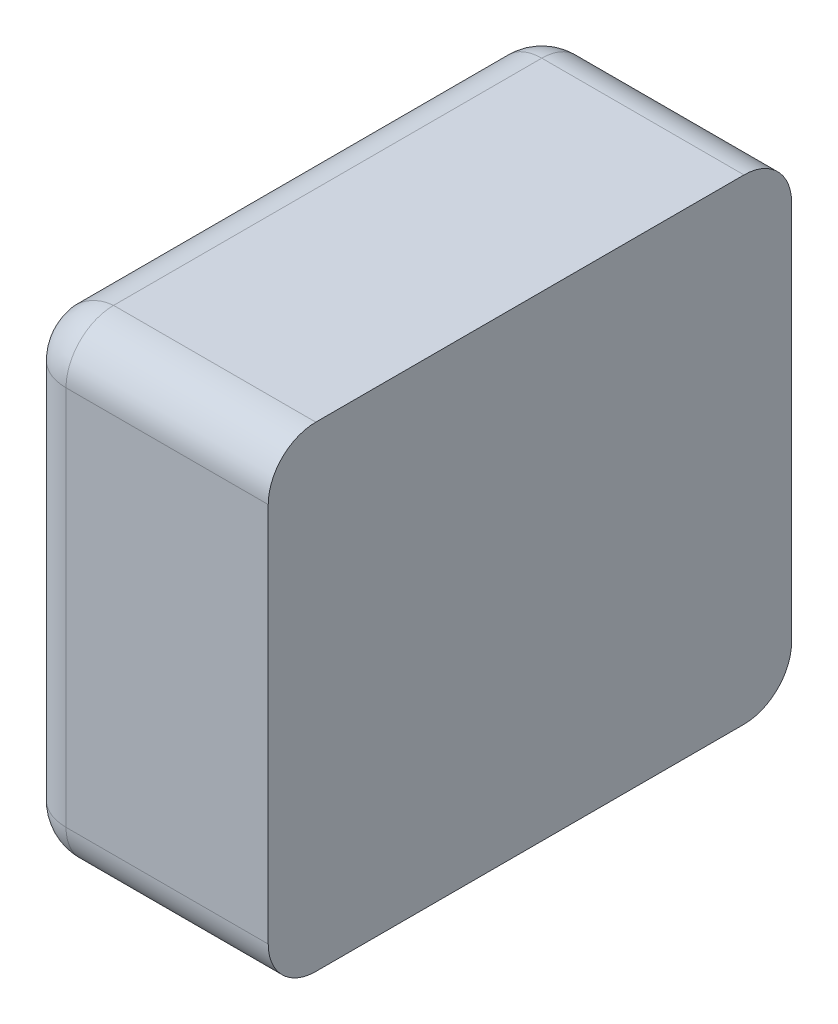
ISO-10303-21;
HEADER;
FILE_DESCRIPTION(('STEP AP214'),'2;1');
FILE_NAME('part.step','',(''),(''),'','','');
FILE_SCHEMA(('AUTOMOTIVE_DESIGN { 1 0 10303 214 1 1 1 1 }'));
ENDSEC;
DATA;
#1=APPLICATION_CONTEXT('core data for automotive mechanical design processes');
#2=APPLICATION_PROTOCOL_DEFINITION('international standard','automotive_design',2000,#1);
#3=PRODUCT_CONTEXT('',#1,'mechanical');
#4=PRODUCT('Part','Part','',(#3));
#5=PRODUCT_RELATED_PRODUCT_CATEGORY('part','',(#4));
#6=PRODUCT_DEFINITION_FORMATION('','',#4);
#7=PRODUCT_DEFINITION_CONTEXT('part definition',#1,'design');
#8=PRODUCT_DEFINITION('design','',#6,#7);
#9=PRODUCT_DEFINITION_SHAPE('','',#8);
#10=(LENGTH_UNIT() NAMED_UNIT(*) SI_UNIT(.MILLI.,.METRE.));
#11=(NAMED_UNIT(*) PLANE_ANGLE_UNIT() SI_UNIT($,.RADIAN.));
#12=(NAMED_UNIT(*) SI_UNIT($,.STERADIAN.) SOLID_ANGLE_UNIT());
#13=UNCERTAINTY_MEASURE_WITH_UNIT(LENGTH_MEASURE(1.E-05),#10,'distance_accuracy_value','');
#14=(GEOMETRIC_REPRESENTATION_CONTEXT(3) GLOBAL_UNCERTAINTY_ASSIGNED_CONTEXT((#13)) GLOBAL_UNIT_ASSIGNED_CONTEXT((#10,
#11,#12)) REPRESENTATION_CONTEXT('',''));
#15=CARTESIAN_POINT('',(0.,0.,0.));
#16=DIRECTION('',(0.,0.,1.));
#17=DIRECTION('',(1.,0.,0.));
#18=AXIS2_PLACEMENT_3D('',#15,#16,#17);
#19=CARTESIAN_POINT('',(-0.1425,0.331275705796617,0.33));
#20=DIRECTION('',(-1.,0.,0.));
#21=DIRECTION('',(0.,-1.,0.));
#22=AXIS2_PLACEMENT_3D('',#19,#20,#21);
#23=PLANE('',#22);
#24=CARTESIAN_POINT('',(-0.1425,0.12,0.3));
#25=DIRECTION('',(-1.,0.,0.));
#26=DIRECTION('',(0.,0.707106781186548,0.707106781186547));
#27=AXIS2_PLACEMENT_3D('',#24,#25,#26);
#28=CIRCLE('',#27,0.03);
#29=CARTESIAN_POINT('',(-0.1425,0.12,0.33));
#30=VERTEX_POINT('',#29);
#31=CARTESIAN_POINT('',(-0.1425,0.15,0.3));
#32=VERTEX_POINT('',#31);
#33=EDGE_CURVE('E11',#30,#32,#28,.T.);
#34=ORIENTED_EDGE('',*,*,#33,.F.);
#35=DIRECTION('',(0.,1.,0.));
#36=VECTOR('',#35,1.);
#37=CARTESIAN_POINT('',(-0.1425,0.165637852898309,0.33));
#38=LINE('',#37,#36);
#39=CARTESIAN_POINT('',(-0.1425,-0.12,0.33));
#40=VERTEX_POINT('',#39);
#41=EDGE_CURVE('E24',#40,#30,#38,.T.);
#42=ORIENTED_EDGE('',*,*,#41,.F.);
#43=CARTESIAN_POINT('',(-0.1425,-0.12,0.3));
#44=DIRECTION('',(-1.,0.,0.));
#45=DIRECTION('',(0.,-0.707106781186548,0.707106781186547));
#46=AXIS2_PLACEMENT_3D('',#43,#44,#45);
#47=CIRCLE('',#46,0.03);
#48=CARTESIAN_POINT('',(-0.1425,-0.15,0.3));
#49=VERTEX_POINT('',#48);
#50=EDGE_CURVE('E307',#49,#40,#47,.T.);
#51=ORIENTED_EDGE('',*,*,#50,.F.);
#52=DIRECTION('',(0.,0.,1.));
#53=VECTOR('',#52,1.);
#54=CARTESIAN_POINT('',(-0.1425,-0.15,0.165));
#55=LINE('',#54,#53);
#56=CARTESIAN_POINT('',(-0.1425,-0.15,0.03));
#57=VERTEX_POINT('',#56);
#58=EDGE_CURVE('E304',#57,#49,#55,.T.);
#59=ORIENTED_EDGE('',*,*,#58,.F.);
#60=CARTESIAN_POINT('',(-0.1425,-0.12,0.03));
#61=DIRECTION('',(-1.,0.,0.));
#62=DIRECTION('',(0.,-0.707106781186547,-0.707106781186548));
#63=AXIS2_PLACEMENT_3D('',#60,#61,#62);
#64=CIRCLE('',#63,0.03);
#65=CARTESIAN_POINT('',(-0.1425,-0.12,0.));
#66=VERTEX_POINT('',#65);
#67=EDGE_CURVE('E301',#66,#57,#64,.T.);
#68=ORIENTED_EDGE('',*,*,#67,.F.);
#69=DIRECTION('',(0.,-1.,0.));
#70=VECTOR('',#69,1.);
#71=CARTESIAN_POINT('',(-0.1425,0.165637852898309,0.));
#72=LINE('',#71,#70);
#73=CARTESIAN_POINT('',(-0.1425,0.12,0.));
#74=VERTEX_POINT('',#73);
#75=EDGE_CURVE('E298',#74,#66,#72,.T.);
#76=ORIENTED_EDGE('',*,*,#75,.F.);
#77=CARTESIAN_POINT('',(-0.1425,0.12,0.03));
#78=DIRECTION('',(-1.,0.,0.));
#79=DIRECTION('',(0.,0.707106781186547,-0.707106781186548));
#80=AXIS2_PLACEMENT_3D('',#77,#78,#79);
#81=CIRCLE('',#80,0.03);
#82=CARTESIAN_POINT('',(-0.1425,0.15,0.03));
#83=VERTEX_POINT('',#82);
#84=EDGE_CURVE('E295',#83,#74,#81,.T.);
#85=ORIENTED_EDGE('',*,*,#84,.F.);
#86=DIRECTION('',(0.,0.,-1.));
#87=VECTOR('',#86,1.);
#88=CARTESIAN_POINT('',(-0.1425,0.15,0.165));
#89=LINE('',#88,#87);
#90=EDGE_CURVE('E292',#32,#83,#89,.T.);
#91=ORIENTED_EDGE('',*,*,#90,.F.);
#92=EDGE_LOOP('',(#34,#42,#51,#59,#68,#76,#85,#91));
#93=FACE_BOUND('',#92,.T.);
#94=ADVANCED_FACE('F17',(#93),#23,.F.);
#95=CARTESIAN_POINT('',(-0.3,-0.15,0.));
#96=DIRECTION('',(0.,-1.,0.));
#97=DIRECTION('',(1.,0.,0.));
#98=AXIS2_PLACEMENT_3D('',#95,#96,#97);
#99=PLANE('',#98);
#100=ORIENTED_EDGE('',*,*,#58,.T.);
#101=DIRECTION('',(1.,0.,0.));
#102=VECTOR('',#101,1.);
#103=CARTESIAN_POINT('',(-0.15,-0.15,0.3));
#104=LINE('',#103,#102);
#105=CARTESIAN_POINT('',(-0.27,-0.15,0.3));
#106=VERTEX_POINT('',#105);
#107=EDGE_CURVE('E290',#106,#49,#104,.T.);
#108=ORIENTED_EDGE('',*,*,#107,.F.);
#109=DIRECTION('',(0.,0.,1.));
#110=VECTOR('',#109,1.);
#111=CARTESIAN_POINT('',(-0.27,-0.15,0.));
#112=LINE('',#111,#110);
#113=CARTESIAN_POINT('',(-0.27,-0.15,0.03));
#114=VERTEX_POINT('',#113);
#115=EDGE_CURVE('E285',#114,#106,#112,.T.);
#116=ORIENTED_EDGE('',*,*,#115,.F.);
#117=DIRECTION('',(-1.,0.,0.));
#118=VECTOR('',#117,1.);
#119=CARTESIAN_POINT('',(-0.15,-0.15,0.03));
#120=LINE('',#119,#118);
#121=EDGE_CURVE('E283',#57,#114,#120,.T.);
#122=ORIENTED_EDGE('',*,*,#121,.F.);
#123=EDGE_LOOP('',(#100,#108,#116,#122));
#124=FACE_BOUND('',#123,.T.);
#125=ADVANCED_FACE('F268',(#124),#99,.T.);
#126=CARTESIAN_POINT('',(-0.15,-0.12,0.03));
#127=DIRECTION('',(1.,0.,0.));
#128=DIRECTION('',(0.,-0.707106781186547,-0.707106781186548));
#129=AXIS2_PLACEMENT_3D('',#126,#127,#128);
#130=CYLINDRICAL_SURFACE('',#129,0.03);
#131=ORIENTED_EDGE('',*,*,#67,.T.);
#132=ORIENTED_EDGE('',*,*,#121,.T.);
#133=CARTESIAN_POINT('',(-0.27,-0.12,0.03));
#134=DIRECTION('',(1.,0.,0.));
#135=DIRECTION('',(0.,-1.,0.));
#136=AXIS2_PLACEMENT_3D('',#133,#134,#135);
#137=CIRCLE('',#136,0.03);
#138=CARTESIAN_POINT('',(-0.27,-0.12,0.));
#139=VERTEX_POINT('',#138);
#140=EDGE_CURVE('E229',#114,#139,#137,.T.);
#141=ORIENTED_EDGE('',*,*,#140,.T.);
#142=DIRECTION('',(1.,0.,0.));
#143=VECTOR('',#142,1.);
#144=CARTESIAN_POINT('',(-0.15,-0.12,0.));
#145=LINE('',#144,#143);
#146=EDGE_CURVE('E224',#139,#66,#145,.T.);
#147=ORIENTED_EDGE('',*,*,#146,.T.);
#148=EDGE_LOOP('',(#131,#132,#141,#147));
#149=FACE_BOUND('',#148,.T.);
#150=ADVANCED_FACE('F265',(#149),#130,.T.);
#151=CARTESIAN_POINT('',(-0.15,-0.12,0.3));
#152=DIRECTION('',(1.,0.,0.));
#153=DIRECTION('',(0.,-0.707106781186548,0.707106781186547));
#154=AXIS2_PLACEMENT_3D('',#151,#152,#153);
#155=CYLINDRICAL_SURFACE('',#154,0.03);
#156=ORIENTED_EDGE('',*,*,#50,.T.);
#157=DIRECTION('',(-1.,0.,0.));
#158=VECTOR('',#157,1.);
#159=CARTESIAN_POINT('',(-0.15,-0.12,0.33));
#160=LINE('',#159,#158);
#161=CARTESIAN_POINT('',(-0.27,-0.12,0.33));
#162=VERTEX_POINT('',#161);
#163=EDGE_CURVE('E203',#40,#162,#160,.T.);
#164=ORIENTED_EDGE('',*,*,#163,.T.);
#165=CARTESIAN_POINT('',(-0.27,-0.12,0.3));
#166=DIRECTION('',(1.,0.,0.));
#167=DIRECTION('',(0.,0.,1.));
#168=AXIS2_PLACEMENT_3D('',#165,#166,#167);
#169=CIRCLE('',#168,0.03);
#170=EDGE_CURVE('E200',#162,#106,#169,.T.);
#171=ORIENTED_EDGE('',*,*,#170,.T.);
#172=ORIENTED_EDGE('',*,*,#107,.T.);
#173=EDGE_LOOP('',(#156,#164,#171,#172));
#174=FACE_BOUND('',#173,.T.);
#175=ADVANCED_FACE('F262',(#174),#155,.T.);
#176=CARTESIAN_POINT('',(0.,0.,0.33));
#177=DIRECTION('',(0.,0.,1.));
#178=DIRECTION('',(1.,0.,0.));
#179=AXIS2_PLACEMENT_3D('',#176,#177,#178);
#180=PLANE('',#179);
#181=ORIENTED_EDGE('',*,*,#41,.T.);
#182=DIRECTION('',(1.,0.,0.));
#183=VECTOR('',#182,1.);
#184=CARTESIAN_POINT('',(0.15,0.12,0.33));
#185=LINE('',#184,#183);
#186=CARTESIAN_POINT('',(-0.27,0.12,0.33));
#187=VERTEX_POINT('',#186);
#188=EDGE_CURVE('E204',#187,#30,#185,.T.);
#189=ORIENTED_EDGE('',*,*,#188,.F.);
#190=DIRECTION('',(0.,1.,0.));
#191=VECTOR('',#190,1.);
#192=CARTESIAN_POINT('',(-0.27,0.0750000000000001,0.33));
#193=LINE('',#192,#191);
#194=EDGE_CURVE('E98',#162,#187,#193,.T.);
#195=ORIENTED_EDGE('',*,*,#194,.F.);
#196=ORIENTED_EDGE('',*,*,#163,.F.);
#197=EDGE_LOOP('',(#181,#189,#195,#196));
#198=FACE_BOUND('',#197,.T.);
#199=ADVANCED_FACE('F208',(#198),#180,.T.);
#200=CARTESIAN_POINT('',(0.15,0.12,0.03));
#201=DIRECTION('',(-1.,0.,0.));
#202=DIRECTION('',(0.,0.707106781186547,-0.707106781186548));
#203=AXIS2_PLACEMENT_3D('',#200,#201,#202);
#204=CYLINDRICAL_SURFACE('',#203,0.03);
#205=ORIENTED_EDGE('',*,*,#84,.T.);
#206=DIRECTION('',(-1.,0.,0.));
#207=VECTOR('',#206,1.);
#208=CARTESIAN_POINT('',(0.15,0.12,0.));
#209=LINE('',#208,#207);
#210=CARTESIAN_POINT('',(-0.27,0.12,0.));
#211=VERTEX_POINT('',#210);
#212=EDGE_CURVE('E209',#74,#211,#209,.T.);
#213=ORIENTED_EDGE('',*,*,#212,.T.);
#214=CARTESIAN_POINT('',(-0.27,0.12,0.03));
#215=DIRECTION('',(1.,0.,0.));
#216=DIRECTION('',(0.,0.,-1.));
#217=AXIS2_PLACEMENT_3D('',#214,#215,#216);
#218=CIRCLE('',#217,0.03);
#219=CARTESIAN_POINT('',(-0.27,0.15,0.03));
#220=VERTEX_POINT('',#219);
#221=EDGE_CURVE('E212',#211,#220,#218,.T.);
#222=ORIENTED_EDGE('',*,*,#221,.T.);
#223=DIRECTION('',(1.,0.,0.));
#224=VECTOR('',#223,1.);
#225=CARTESIAN_POINT('',(0.15,0.15,0.03));
#226=LINE('',#225,#224);
#227=EDGE_CURVE('E344',#220,#83,#226,.T.);
#228=ORIENTED_EDGE('',*,*,#227,.T.);
#229=EDGE_LOOP('',(#205,#213,#222,#228));
#230=FACE_BOUND('',#229,.T.);
#231=ADVANCED_FACE('F255',(#230),#204,.T.);
#232=CARTESIAN_POINT('',(-0.27,0.0750000000000001,0.03));
#233=DIRECTION('',(0.,-1.,0.));
#234=DIRECTION('',(-0.707106781186547,0.,-0.707106781186548));
#235=AXIS2_PLACEMENT_3D('',#232,#233,#234);
#236=CYLINDRICAL_SURFACE('',#235,0.03);
#237=CARTESIAN_POINT('',(-0.27,0.12,0.03));
#238=DIRECTION('',(0.,-1.,0.));
#239=DIRECTION('',(-1.,0.,0.));
#240=AXIS2_PLACEMENT_3D('',#237,#238,#239);
#241=CIRCLE('',#240,0.03);
#242=CARTESIAN_POINT('',(-0.3,0.12,0.03));
#243=VERTEX_POINT('',#242);
#244=EDGE_CURVE('E341',#243,#211,#241,.T.);
#245=ORIENTED_EDGE('',*,*,#244,.T.);
#246=DIRECTION('',(0.,-1.,0.));
#247=VECTOR('',#246,1.);
#248=CARTESIAN_POINT('',(-0.27,0.0750000000000001,0.));
#249=LINE('',#248,#247);
#250=EDGE_CURVE('E336',#211,#139,#249,.T.);
#251=ORIENTED_EDGE('',*,*,#250,.T.);
#252=CARTESIAN_POINT('',(-0.27,-0.12,0.03));
#253=DIRECTION('',(0.,1.,0.));
#254=DIRECTION('',(0.,0.,-1.));
#255=AXIS2_PLACEMENT_3D('',#252,#253,#254);
#256=CIRCLE('',#255,0.03);
#257=CARTESIAN_POINT('',(-0.3,-0.12,0.03));
#258=VERTEX_POINT('',#257);
#259=EDGE_CURVE('E332',#139,#258,#256,.T.);
#260=ORIENTED_EDGE('',*,*,#259,.T.);
#261=DIRECTION('',(0.,1.,0.));
#262=VECTOR('',#261,1.);
#263=CARTESIAN_POINT('',(-0.3,0.0750000000000001,0.03));
#264=LINE('',#263,#262);
#265=EDGE_CURVE('E329',#258,#243,#264,.T.);
#266=ORIENTED_EDGE('',*,*,#265,.T.);
#267=EDGE_LOOP('',(#245,#251,#260,#266));
#268=FACE_BOUND('',#267,.T.);
#269=ADVANCED_FACE('F251',(#268),#236,.T.);
#270=CARTESIAN_POINT('',(-0.27,0.12,0.03));
#271=DIRECTION('',(-0.816496580927727,-0.408248290463863,0.408248290463862));
#272=DIRECTION('',(-0.577350269189625,0.577350269189627,-0.577350269189626));
#273=AXIS2_PLACEMENT_3D('',#270,#271,#272);
#274=SPHERICAL_SURFACE('',#273,0.03);
#275=ORIENTED_EDGE('',*,*,#244,.F.);
#276=CARTESIAN_POINT('',(-0.27,0.12,0.03));
#277=DIRECTION('',(0.,0.,-1.));
#278=DIRECTION('',(-0.707106781186546,0.707106781186549,0.));
#279=AXIS2_PLACEMENT_3D('',#276,#277,#278);
#280=CIRCLE('',#279,0.03);
#281=EDGE_CURVE('E131',#243,#220,#280,.T.);
#282=ORIENTED_EDGE('',*,*,#281,.T.);
#283=ORIENTED_EDGE('',*,*,#221,.F.);
#284=EDGE_LOOP('',(#275,#282,#283));
#285=FACE_BOUND('',#284,.T.);
#286=ADVANCED_FACE('F247',(#285),#274,.T.);
#287=CARTESIAN_POINT('',(-0.27,-0.12,0.03));
#288=DIRECTION('',(0.408248290463862,0.408248290463862,-0.816496580927727));
#289=DIRECTION('',(-0.577350269189628,-0.577350269189626,-0.577350269189624));
#290=AXIS2_PLACEMENT_3D('',#287,#288,#289);
#291=SPHERICAL_SURFACE('',#290,0.03);
#292=ORIENTED_EDGE('',*,*,#140,.F.);
#293=CARTESIAN_POINT('',(-0.27,-0.12,0.03));
#294=DIRECTION('',(0.,0.,-1.));
#295=DIRECTION('',(-0.707106781186548,-0.707106781186548,0.));
#296=AXIS2_PLACEMENT_3D('',#293,#294,#295);
#297=CIRCLE('',#296,0.03);
#298=EDGE_CURVE('E323',#114,#258,#297,.T.);
#299=ORIENTED_EDGE('',*,*,#298,.T.);
#300=ORIENTED_EDGE('',*,*,#259,.F.);
#301=EDGE_LOOP('',(#292,#299,#300));
#302=FACE_BOUND('',#301,.T.);
#303=ADVANCED_FACE('F236',(#302),#291,.T.);
#304=CARTESIAN_POINT('',(-0.27,-0.12,0.));
#305=DIRECTION('',(0.,0.,1.));
#306=DIRECTION('',(-0.707106781186548,-0.707106781186547,0.));
#307=AXIS2_PLACEMENT_3D('',#304,#305,#306);
#308=CYLINDRICAL_SURFACE('',#307,0.03);
#309=ORIENTED_EDGE('',*,*,#298,.F.);
#310=ORIENTED_EDGE('',*,*,#115,.T.);
#311=CARTESIAN_POINT('',(-0.27,-0.12,0.3));
#312=DIRECTION('',(0.,0.,1.));
#313=DIRECTION('',(-0.707106781186548,-0.707106781186548,0.));
#314=AXIS2_PLACEMENT_3D('',#311,#312,#313);
#315=CIRCLE('',#314,0.03);
#316=CARTESIAN_POINT('',(-0.3,-0.12,0.3));
#317=VERTEX_POINT('',#316);
#318=EDGE_CURVE('E198',#317,#106,#315,.T.);
#319=ORIENTED_EDGE('',*,*,#318,.F.);
#320=DIRECTION('',(0.,0.,-1.));
#321=VECTOR('',#320,1.);
#322=CARTESIAN_POINT('',(-0.3,-0.12,0.));
#323=LINE('',#322,#321);
#324=EDGE_CURVE('E115',#317,#258,#323,.T.);
#325=ORIENTED_EDGE('',*,*,#324,.T.);
#326=EDGE_LOOP('',(#309,#310,#319,#325));
#327=FACE_BOUND('',#326,.T.);
#328=ADVANCED_FACE('F246',(#327),#308,.T.);
#329=CARTESIAN_POINT('',(0.,0.,0.));
#330=DIRECTION('',(0.,0.,1.));
#331=DIRECTION('',(1.,0.,0.));
#332=AXIS2_PLACEMENT_3D('',#329,#330,#331);
#333=PLANE('',#332);
#334=ORIENTED_EDGE('',*,*,#75,.T.);
#335=ORIENTED_EDGE('',*,*,#146,.F.);
#336=ORIENTED_EDGE('',*,*,#250,.F.);
#337=ORIENTED_EDGE('',*,*,#212,.F.);
#338=EDGE_LOOP('',(#334,#335,#336,#337));
#339=FACE_BOUND('',#338,.T.);
#340=ADVANCED_FACE('F358',(#339),#333,.F.);
#341=CARTESIAN_POINT('',(0.15,0.12,0.3));
#342=DIRECTION('',(-1.,0.,0.));
#343=DIRECTION('',(0.,0.707106781186548,0.707106781186547));
#344=AXIS2_PLACEMENT_3D('',#341,#342,#343);
#345=CYLINDRICAL_SURFACE('',#344,0.03);
#346=ORIENTED_EDGE('',*,*,#33,.T.);
#347=DIRECTION('',(-1.,0.,0.));
#348=VECTOR('',#347,1.);
#349=CARTESIAN_POINT('',(0.15,0.15,0.3));
#350=LINE('',#349,#348);
#351=CARTESIAN_POINT('',(-0.27,0.15,0.3));
#352=VERTEX_POINT('',#351);
#353=EDGE_CURVE('E310',#32,#352,#350,.T.);
#354=ORIENTED_EDGE('',*,*,#353,.T.);
#355=CARTESIAN_POINT('',(-0.27,0.12,0.3));
#356=DIRECTION('',(1.,0.,0.));
#357=DIRECTION('',(0.,1.,0.));
#358=AXIS2_PLACEMENT_3D('',#355,#356,#357);
#359=CIRCLE('',#358,0.03);
#360=EDGE_CURVE('E104',#352,#187,#359,.T.);
#361=ORIENTED_EDGE('',*,*,#360,.T.);
#362=ORIENTED_EDGE('',*,*,#188,.T.);
#363=EDGE_LOOP('',(#346,#354,#361,#362));
#364=FACE_BOUND('',#363,.T.);
#365=ADVANCED_FACE('F181',(#364),#345,.T.);
#366=CARTESIAN_POINT('',(-0.27,0.0750000000000001,0.3));
#367=DIRECTION('',(0.,-1.,0.));
#368=DIRECTION('',(-0.707106781186548,0.,0.707106781186548));
#369=AXIS2_PLACEMENT_3D('',#366,#367,#368);
#370=CYLINDRICAL_SURFACE('',#369,0.03);
#371=CARTESIAN_POINT('',(-0.27,0.12,0.3));
#372=DIRECTION('',(0.,-1.,0.));
#373=DIRECTION('',(0.,0.,1.));
#374=AXIS2_PLACEMENT_3D('',#371,#372,#373);
#375=CIRCLE('',#374,0.03);
#376=CARTESIAN_POINT('',(-0.3,0.12,0.3));
#377=VERTEX_POINT('',#376);
#378=EDGE_CURVE('E90',#187,#377,#375,.T.);
#379=ORIENTED_EDGE('',*,*,#378,.T.);
#380=DIRECTION('',(0.,-1.,0.));
#381=VECTOR('',#380,1.);
#382=CARTESIAN_POINT('',(-0.3,0.0750000000000001,0.3));
#383=LINE('',#382,#381);
#384=EDGE_CURVE('E95',#377,#317,#383,.T.);
#385=ORIENTED_EDGE('',*,*,#384,.T.);
#386=CARTESIAN_POINT('',(-0.27,-0.12,0.3));
#387=DIRECTION('',(0.,1.,0.));
#388=DIRECTION('',(-1.,0.,0.));
#389=AXIS2_PLACEMENT_3D('',#386,#387,#388);
#390=CIRCLE('',#389,0.03);
#391=EDGE_CURVE('E116',#317,#162,#390,.T.);
#392=ORIENTED_EDGE('',*,*,#391,.T.);
#393=ORIENTED_EDGE('',*,*,#194,.T.);
#394=EDGE_LOOP('',(#379,#385,#392,#393));
#395=FACE_BOUND('',#394,.T.);
#396=ADVANCED_FACE('F93',(#395),#370,.T.);
#397=CARTESIAN_POINT('',(-0.27,-0.12,0.3));
#398=DIRECTION('',(-0.408248290463864,-0.408248290463863,-0.816496580927726));
#399=DIRECTION('',(-0.577350269189626,-0.577350269189625,0.577350269189626));
#400=AXIS2_PLACEMENT_3D('',#397,#398,#399);
#401=SPHERICAL_SURFACE('',#400,0.03);
#402=ORIENTED_EDGE('',*,*,#391,.F.);
#403=ORIENTED_EDGE('',*,*,#318,.T.);
#404=ORIENTED_EDGE('',*,*,#170,.F.);
#405=EDGE_LOOP('',(#402,#403,#404));
#406=FACE_BOUND('',#405,.T.);
#407=ADVANCED_FACE('F156',(#406),#401,.T.);
#408=CARTESIAN_POINT('',(-0.27,0.12,0.3));
#409=DIRECTION('',(-0.816496580927727,-0.408248290463863,-0.408248290463862));
#410=DIRECTION('',(-0.577350269189625,0.577350269189626,0.577350269189626));
#411=AXIS2_PLACEMENT_3D('',#408,#409,#410);
#412=SPHERICAL_SURFACE('',#411,0.03);
#413=ORIENTED_EDGE('',*,*,#360,.F.);
#414=CARTESIAN_POINT('',(-0.27,0.15,0.3));
#415=CARTESIAN_POINT('',(-0.2704988114566,0.15000001218838,0.300033885984529));
#416=CARTESIAN_POINT('',(-0.270997266674897,0.149987502790529,0.300072700986934));
#417=CARTESIAN_POINT('',(-0.271994414549251,0.149937417339022,0.300159234717374));
#418=CARTESIAN_POINT('',(-0.272493098142923,0.149899728520835,0.300206992800863));
#419=CARTESIAN_POINT('',(-0.273489141663646,0.149799058547557,0.300310340802986));
#420=CARTESIAN_POINT('',(-0.273986488076972,0.149735975701535,0.300365961620001));
#421=CARTESIAN_POINT('',(-0.274978329987218,0.149584423439013,0.300483912490024));
#422=CARTESIAN_POINT('',(-0.275472809014332,0.149495864378045,0.30054626574015));
#423=CARTESIAN_POINT('',(-0.276457408349491,0.149293375435409,0.300676517251717));
#424=CARTESIAN_POINT('',(-0.276947510656095,0.14917936863514,0.300744431920565));
#425=CARTESIAN_POINT('',(-0.277921879210046,0.148926117168614,0.300884606505975));
#426=CARTESIAN_POINT('',(-0.278406127362682,0.148786808810621,0.300956877073712));
#427=CARTESIAN_POINT('',(-0.279367344700468,0.148483203157651,0.301104535317345));
#428=CARTESIAN_POINT('',(-0.279844297105908,0.148318855688421,0.301179929025555));
#429=CARTESIAN_POINT('',(-0.280789520120333,0.14796553704088,0.301332584129445));
#430=CARTESIAN_POINT('',(-0.281257776631302,0.147776529291588,0.301409848157373));
#431=CARTESIAN_POINT('',(-0.282184250050681,0.147374370790128,0.301564980486512));
#432=CARTESIAN_POINT('',(-0.282642456850724,0.147161196950527,0.301642849298233));
#433=CARTESIAN_POINT('',(-0.28354752291707,0.146711301214479,0.301797921149039));
#434=CARTESIAN_POINT('',(-0.283994377299662,0.146474569391927,0.301875123892462));
#435=CARTESIAN_POINT('',(-0.284875485043225,0.145978265027613,0.302027594347783));
#436=CARTESIAN_POINT('',(-0.28530973989387,0.145718695200802,0.302102862288317));
#437=CARTESIAN_POINT('',(-0.286164453839678,0.145177532158359,0.302250202096889));
#438=CARTESIAN_POINT('',(-0.286584921848203,0.144895953586706,0.302322276040923));
#439=CARTESIAN_POINT('',(-0.287410930152302,0.144311697423408,0.302461982438935));
#440=CARTESIAN_POINT('',(-0.287816487725631,0.144009045509089,0.302529620109706));
#441=CARTESIAN_POINT('',(-0.288611609698811,0.143383670573753,0.302659231507785));
#442=CARTESIAN_POINT('',(-0.289001200561672,0.143060983194026,0.302721214834487));
#443=CARTESIAN_POINT('',(-0.289763393553022,0.142396664765597,0.302838325292687));
#444=CARTESIAN_POINT('',(-0.290136032021387,0.142055078090956,0.302893467574624));
#445=CARTESIAN_POINT('',(-0.290863397634121,0.141354183506085,0.302995740989442));
#446=CARTESIAN_POINT('',(-0.29121817154898,0.140994927323628,0.303042893897565));
#447=CARTESIAN_POINT('',(-0.291908961165091,0.140260006134148,0.303128077826375));
#448=CARTESIAN_POINT('',(-0.292245034475513,0.139884398697804,0.303166138205415));
#449=CARTESIAN_POINT('',(-0.292897654069066,0.139118171903413,0.303232077255572));
#450=CARTESIAN_POINT('',(-0.293214269055406,0.138727614334856,0.303259993690955));
#451=CARTESIAN_POINT('',(-0.293827283277693,0.137932962741796,0.303304642403207));
#452=CARTESIAN_POINT('',(-0.294123762407378,0.137528933009151,0.30332142151845));
#453=CARTESIAN_POINT('',(-0.294695897931203,0.136708884767313,0.303342856676105));
#454=CARTESIAN_POINT('',(-0.294971645342014,0.136292931267141,0.303347569126694));
#455=CARTESIAN_POINT('',(-0.295501793454286,0.135450648652353,0.303344001427956));
#456=CARTESIAN_POINT('',(-0.295756296059558,0.135024383436286,0.303335787563462));
#457=CARTESIAN_POINT('',(-0.296243514501363,0.134163148910546,0.303305572586257));
#458=CARTESIAN_POINT('',(-0.296476342722002,0.133728240548299,0.303283647738719));
#459=CARTESIAN_POINT('',(-0.29691985675561,0.132851442274516,0.303225296173099));
#460=CARTESIAN_POINT('',(-0.297130664853887,0.132409608537143,0.303188955588915));
#461=CARTESIAN_POINT('',(-0.297529867626478,0.131520725008768,0.303101142559795));
#462=CARTESIAN_POINT('',(-0.297718393736061,0.131073724852721,0.30304976578243));
#463=CARTESIAN_POINT('',(-0.298072845692959,0.130176310223072,0.302931339667545));
#464=CARTESIAN_POINT('',(-0.298238911206526,0.129725937163117,0.302864394964426));
#465=CARTESIAN_POINT('',(-0.298548339496165,0.128823601756171,0.302714383979636));
#466=CARTESIAN_POINT('',(-0.29869184908149,0.128371671082917,0.302631430511459));
#467=CARTESIAN_POINT('',(-0.298956143515048,0.12746807783126,0.30244905323905));
#468=CARTESIAN_POINT('',(-0.299077081092125,0.127016435722467,0.3023497493774));
#469=CARTESIAN_POINT('',(-0.29929629941659,0.126115236256513,0.302134406235816));
#470=CARTESIAN_POINT('',(-0.299394737369101,0.125665687375364,0.302018492898807));
#471=CARTESIAN_POINT('',(-0.299525735241222,0.1249931673045,0.301831639421765));
#472=CARTESIAN_POINT('',(-0.299566536092966,0.124769899562591,0.301767383329066));
#473=CARTESIAN_POINT('',(-0.29964255533454,0.12432458245702,0.301634658700018));
#474=CARTESIAN_POINT('',(-0.299677793860668,0.124102531645172,0.301566206664674));
#475=CARTESIAN_POINT('',(-0.299742716016461,0.123659887617396,0.301425089688796));
#476=CARTESIAN_POINT('',(-0.299772419851868,0.123439292053119,0.301352441393567));
#477=CARTESIAN_POINT('',(-0.299826307791658,0.122999785093463,0.301202935202406));
#478=CARTESIAN_POINT('',(-0.299850512107089,0.12278087048501,0.301126094051073));
#479=CARTESIAN_POINT('',(-0.299893439937734,0.122344953783418,0.300968212611414));
#480=CARTESIAN_POINT('',(-0.299912183618114,0.122127947599275,0.300887189107669));
#481=CARTESIAN_POINT('',(-0.29994423389955,0.121696073785566,0.300720959873868));
#482=CARTESIAN_POINT('',(-0.299957560563846,0.121481201194103,0.300635770910294));
#483=CARTESIAN_POINT('',(-0.299978824512546,0.121053818670956,0.300461233663095));
#484=CARTESIAN_POINT('',(-0.299986781704457,0.120841302917413,0.300371902070379));
#485=CARTESIAN_POINT('',(-0.299997360045311,0.1204188571993,0.30018911098433));
#486=CARTESIAN_POINT('',(-0.300000000885541,0.120208920565759,0.300095668038792));
#487=CARTESIAN_POINT('',(-0.3,0.12,0.3));
#488=B_SPLINE_CURVE_WITH_KNOTS('',3,(#414,#415,#416,#417,#418,#419,#420,#421,#422,#423,#424,
#425,#426,#427,#428,#429,#430,#431,#432,#433,#434,#435,#436,#437,#438,#439,#440,#441,#442,#443,
#444,#445,#446,#447,#448,#449,#450,#451,#452,#453,#454,#455,#456,#457,#458,#459,#460,#461,#462,
#463,#464,#465,#466,#467,#468,#469,#470,#471,#472,#473,#474,#475,#476,#477,#478,#479,#480,#481,
#482,#483,#484,#485,#486,#487),.UNSPECIFIED.,.F.,.F.,(4,2,2,2,2,2,2,2,2,2,2,2,2,2,2,2,2,2,2,2,2,
2,2,2,2,2,2,2,2,2,2,2,2,2,2,2,4),(0.,0.00149967209897315,0.00300610581741704,
0.00451863306598448,0.00603654902173451,0.00755911671607726,0.00908557168251716,
0.0106151266516607,0.0121469762827746,0.0136803019226446,0.0152142763836234,0.016748068733572,
0.0182808490909205,0.0198117934182993,0.0213400883081261,0.0228649357531863,0.0243855578945877,
0.0259012017385216,0.0274111438319798,0.0289146948859602,0.0304112043327167,0.0319000648012526,
0.0333807164925053,0.034852651432517,0.0363154175783271,0.0377686227473786,0.039211938336944,
0.0406451027955086,0.0420679248033106,0.0427754956156011,0.0434804430889857,0.0441827642722291,
0.0448824610624082,0.0455795402560941,0.0462740135921418,0.0469658977856005,0.0476552145522495),.UNSPECIFIED.);
#489=EDGE_CURVE('E119',#352,#377,#488,.T.);
#490=ORIENTED_EDGE('',*,*,#489,.T.);
#491=ORIENTED_EDGE('',*,*,#378,.F.);
#492=EDGE_LOOP('',(#413,#490,#491));
#493=FACE_BOUND('',#492,.T.);
#494=ADVANCED_FACE('F121',(#493),#412,.T.);
#495=CARTESIAN_POINT('',(-0.3,0.15,0.));
#496=DIRECTION('',(-1.,0.,0.));
#497=DIRECTION('',(0.,-1.,0.));
#498=AXIS2_PLACEMENT_3D('',#495,#496,#497);
#499=PLANE('',#498);
#500=ORIENTED_EDGE('',*,*,#265,.F.);
#501=ORIENTED_EDGE('',*,*,#324,.F.);
#502=ORIENTED_EDGE('',*,*,#384,.F.);
#503=DIRECTION('',(0.,0.,1.));
#504=VECTOR('',#503,1.);
#505=CARTESIAN_POINT('',(-0.3,0.12,0.));
#506=LINE('',#505,#504);
#507=EDGE_CURVE('E113',#243,#377,#506,.T.);
#508=ORIENTED_EDGE('',*,*,#507,.F.);
#509=EDGE_LOOP('',(#500,#501,#502,#508));
#510=FACE_BOUND('',#509,.T.);
#511=ADVANCED_FACE('F111',(#510),#499,.T.);
#512=CARTESIAN_POINT('',(-0.27,0.12,0.));
#513=DIRECTION('',(0.,0.,1.));
#514=DIRECTION('',(-0.707106781186547,0.707106781186548,0.));
#515=AXIS2_PLACEMENT_3D('',#512,#513,#514);
#516=CYLINDRICAL_SURFACE('',#515,0.03);
#517=ORIENTED_EDGE('',*,*,#281,.F.);
#518=ORIENTED_EDGE('',*,*,#507,.T.);
#519=ORIENTED_EDGE('',*,*,#489,.F.);
#520=DIRECTION('',(0.,0.,-1.));
#521=VECTOR('',#520,1.);
#522=CARTESIAN_POINT('',(-0.27,0.15,0.));
#523=LINE('',#522,#521);
#524=EDGE_CURVE('E132',#352,#220,#523,.T.);
#525=ORIENTED_EDGE('',*,*,#524,.T.);
#526=EDGE_LOOP('',(#517,#518,#519,#525));
#527=FACE_BOUND('',#526,.T.);
#528=ADVANCED_FACE('F129',(#527),#516,.T.);
#529=CARTESIAN_POINT('',(0.300000000000001,0.15,0.));
#530=DIRECTION('',(0.,1.,0.));
#531=DIRECTION('',(-1.,0.,0.));
#532=AXIS2_PLACEMENT_3D('',#529,#530,#531);
#533=PLANE('',#532);
#534=ORIENTED_EDGE('',*,*,#90,.T.);
#535=ORIENTED_EDGE('',*,*,#227,.F.);
#536=ORIENTED_EDGE('',*,*,#524,.F.);
#537=ORIENTED_EDGE('',*,*,#353,.F.);
#538=EDGE_LOOP('',(#534,#535,#536,#537));
#539=FACE_BOUND('',#538,.T.);
#540=ADVANCED_FACE('F150',(#539),#533,.T.);
#541=CLOSED_SHELL('',(#94,#125,#150,#175,#199,#231,#269,#286,#303,#328,#340,#365,#396,#407,#494,
#511,#528,#540));
#542=MANIFOLD_SOLID_BREP('B1',#541);
#543=ADVANCED_BREP_SHAPE_REPRESENTATION('',(#18,#542),#14);
#544=SHAPE_DEFINITION_REPRESENTATION(#9,#543);
ENDSEC;
END-ISO-10303-21;
